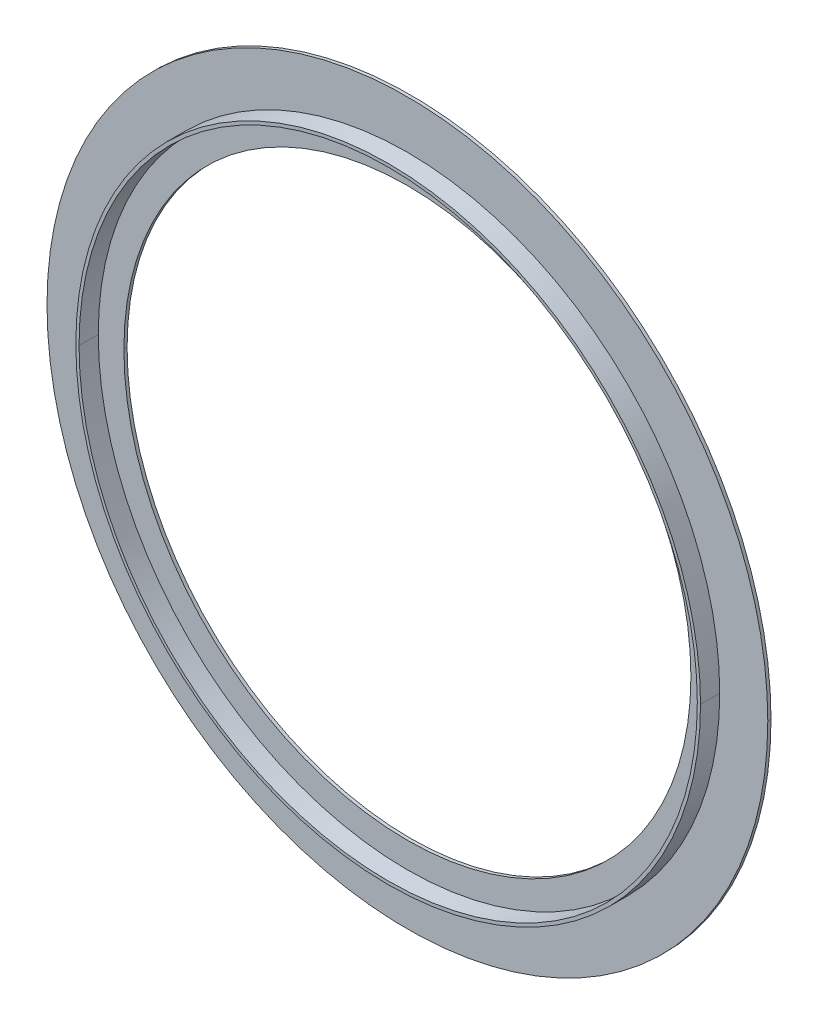
ISO-10303-21;
HEADER;
FILE_DESCRIPTION(('STEP AP214'),'2;1');
FILE_NAME('part.step','',(''),(''),'','','');
FILE_SCHEMA(('AUTOMOTIVE_DESIGN { 1 0 10303 214 1 1 1 1 }'));
ENDSEC;
DATA;
#1=APPLICATION_CONTEXT('core data for automotive mechanical design processes');
#2=APPLICATION_PROTOCOL_DEFINITION('international standard','automotive_design',2000,#1);
#3=PRODUCT_CONTEXT('',#1,'mechanical');
#4=PRODUCT('Part','Part','',(#3));
#5=PRODUCT_RELATED_PRODUCT_CATEGORY('part','',(#4));
#6=PRODUCT_DEFINITION_FORMATION('','',#4);
#7=PRODUCT_DEFINITION_CONTEXT('part definition',#1,'design');
#8=PRODUCT_DEFINITION('design','',#6,#7);
#9=PRODUCT_DEFINITION_SHAPE('','',#8);
#10=(LENGTH_UNIT() NAMED_UNIT(*) SI_UNIT(.MILLI.,.METRE.));
#11=(NAMED_UNIT(*) PLANE_ANGLE_UNIT() SI_UNIT($,.RADIAN.));
#12=(NAMED_UNIT(*) SI_UNIT($,.STERADIAN.) SOLID_ANGLE_UNIT());
#13=UNCERTAINTY_MEASURE_WITH_UNIT(LENGTH_MEASURE(1.E-05),#10,'distance_accuracy_value','');
#14=(GEOMETRIC_REPRESENTATION_CONTEXT(3) GLOBAL_UNCERTAINTY_ASSIGNED_CONTEXT((#13)) GLOBAL_UNIT_ASSIGNED_CONTEXT((#10,
#11,#12)) REPRESENTATION_CONTEXT('',''));
#15=CARTESIAN_POINT('',(0.,0.,0.));
#16=DIRECTION('',(0.,0.,1.));
#17=DIRECTION('',(1.,0.,0.));
#18=AXIS2_PLACEMENT_3D('',#15,#16,#17);
#19=CARTESIAN_POINT('',(0.,0.,7.));
#20=DIRECTION('',(0.,0.,-1.));
#21=DIRECTION('',(-1.,0.,0.));
#22=AXIS2_PLACEMENT_3D('',#19,#20,#21);
#23=CYLINDRICAL_SURFACE('',#22,96.5);
#24=CARTESIAN_POINT('',(0.,0.,7.));
#25=DIRECTION('',(0.,0.,1.));
#26=DIRECTION('',(1.,0.,0.));
#27=AXIS2_PLACEMENT_3D('',#24,#25,#26);
#28=CIRCLE('',#27,96.5);
#29=CARTESIAN_POINT('',(-96.5,0.,7.));
#30=VERTEX_POINT('',#29);
#31=CARTESIAN_POINT('',(96.5,0.,7.));
#32=VERTEX_POINT('',#31);
#33=EDGE_CURVE('E11',#30,#32,#28,.T.);
#34=ORIENTED_EDGE('',*,*,#33,.T.);
#35=DIRECTION('',(0.,0.,-1.));
#36=VECTOR('',#35,1.);
#37=CARTESIAN_POINT('',(96.5,0.,7.));
#38=LINE('',#37,#36);
#39=CARTESIAN_POINT('',(96.5,0.,1.));
#40=VERTEX_POINT('',#39);
#41=EDGE_CURVE('E26',#32,#40,#38,.T.);
#42=ORIENTED_EDGE('',*,*,#41,.T.);
#43=CARTESIAN_POINT('',(0.,0.,1.));
#44=DIRECTION('',(0.,0.,-1.));
#45=DIRECTION('',(1.,0.,0.));
#46=AXIS2_PLACEMENT_3D('',#43,#44,#45);
#47=CIRCLE('',#46,96.5);
#48=CARTESIAN_POINT('',(-96.5,0.,1.));
#49=VERTEX_POINT('',#48);
#50=EDGE_CURVE('E120',#40,#49,#47,.T.);
#51=ORIENTED_EDGE('',*,*,#50,.T.);
#52=DIRECTION('',(0.,0.,-1.));
#53=VECTOR('',#52,1.);
#54=CARTESIAN_POINT('',(-96.5,0.,7.));
#55=LINE('',#54,#53);
#56=EDGE_CURVE('E146',#30,#49,#55,.T.);
#57=ORIENTED_EDGE('',*,*,#56,.F.);
#58=EDGE_LOOP('',(#34,#42,#51,#57));
#59=FACE_BOUND('',#58,.T.);
#60=ADVANCED_FACE('F16',(#59),#23,.F.);
#61=CARTESIAN_POINT('',(0.,0.,7.));
#62=DIRECTION('',(0.,0.,-1.));
#63=DIRECTION('',(-1.,0.,0.));
#64=AXIS2_PLACEMENT_3D('',#61,#62,#63);
#65=CYLINDRICAL_SURFACE('',#64,97.5);
#66=CARTESIAN_POINT('',(0.,0.,7.));
#67=DIRECTION('',(0.,0.,1.));
#68=DIRECTION('',(1.,0.,0.));
#69=AXIS2_PLACEMENT_3D('',#66,#67,#68);
#70=CIRCLE('',#69,97.5);
#71=CARTESIAN_POINT('',(97.5,0.,7.));
#72=VERTEX_POINT('',#71);
#73=CARTESIAN_POINT('',(-97.5,0.,7.));
#74=VERTEX_POINT('',#73);
#75=EDGE_CURVE('E105',#72,#74,#70,.T.);
#76=ORIENTED_EDGE('',*,*,#75,.F.);
#77=DIRECTION('',(0.,0.,-1.));
#78=VECTOR('',#77,1.);
#79=CARTESIAN_POINT('',(97.5,0.,7.));
#80=LINE('',#79,#78);
#81=CARTESIAN_POINT('',(97.5,0.,1.));
#82=VERTEX_POINT('',#81);
#83=EDGE_CURVE('E108',#72,#82,#80,.T.);
#84=ORIENTED_EDGE('',*,*,#83,.T.);
#85=CARTESIAN_POINT('',(0.,0.,1.));
#86=DIRECTION('',(0.,0.,1.));
#87=DIRECTION('',(1.,0.,0.));
#88=AXIS2_PLACEMENT_3D('',#85,#86,#87);
#89=CIRCLE('',#88,97.5);
#90=CARTESIAN_POINT('',(-97.5,0.,1.));
#91=VERTEX_POINT('',#90);
#92=EDGE_CURVE('E96',#82,#91,#89,.T.);
#93=ORIENTED_EDGE('',*,*,#92,.T.);
#94=DIRECTION('',(0.,0.,-1.));
#95=VECTOR('',#94,1.);
#96=CARTESIAN_POINT('',(-97.5,0.,7.));
#97=LINE('',#96,#95);
#98=EDGE_CURVE('E110',#74,#91,#97,.T.);
#99=ORIENTED_EDGE('',*,*,#98,.F.);
#100=EDGE_LOOP('',(#76,#84,#93,#99));
#101=FACE_BOUND('',#100,.T.);
#102=ADVANCED_FACE('F107',(#101),#65,.T.);
#103=CARTESIAN_POINT('',(0.,0.,0.));
#104=DIRECTION('',(0.,0.,1.));
#105=DIRECTION('',(1.,0.,0.));
#106=AXIS2_PLACEMENT_3D('',#103,#104,#105);
#107=CYLINDRICAL_SURFACE('',#106,88.5);
#108=CARTESIAN_POINT('',(0.,0.,0.));
#109=DIRECTION('',(0.,0.,1.));
#110=DIRECTION('',(1.,0.,0.));
#111=AXIS2_PLACEMENT_3D('',#108,#109,#110);
#112=CIRCLE('',#111,88.5);
#113=CARTESIAN_POINT('',(-88.5,0.,0.));
#114=VERTEX_POINT('',#113);
#115=CARTESIAN_POINT('',(88.5,0.,0.));
#116=VERTEX_POINT('',#115);
#117=EDGE_CURVE('E141',#114,#116,#112,.T.);
#118=ORIENTED_EDGE('',*,*,#117,.F.);
#119=DIRECTION('',(0.,0.,1.));
#120=VECTOR('',#119,1.);
#121=CARTESIAN_POINT('',(-88.5,0.,0.));
#122=LINE('',#121,#120);
#123=CARTESIAN_POINT('',(-88.5,0.,1.));
#124=VERTEX_POINT('',#123);
#125=EDGE_CURVE('E162',#114,#124,#122,.T.);
#126=ORIENTED_EDGE('',*,*,#125,.T.);
#127=CARTESIAN_POINT('',(0.,0.,1.));
#128=DIRECTION('',(0.,0.,1.));
#129=DIRECTION('',(1.,0.,0.));
#130=AXIS2_PLACEMENT_3D('',#127,#128,#129);
#131=CIRCLE('',#130,88.5);
#132=CARTESIAN_POINT('',(88.5,0.,1.));
#133=VERTEX_POINT('',#132);
#134=EDGE_CURVE('E158',#124,#133,#131,.T.);
#135=ORIENTED_EDGE('',*,*,#134,.T.);
#136=DIRECTION('',(0.,0.,1.));
#137=VECTOR('',#136,1.);
#138=CARTESIAN_POINT('',(88.5,0.,0.));
#139=LINE('',#138,#137);
#140=EDGE_CURVE('E132',#116,#133,#139,.T.);
#141=ORIENTED_EDGE('',*,*,#140,.F.);
#142=EDGE_LOOP('',(#118,#126,#135,#141));
#143=FACE_BOUND('',#142,.T.);
#144=ADVANCED_FACE('F324',(#143),#107,.F.);
#145=CARTESIAN_POINT('',(0.,0.,1.));
#146=DIRECTION('',(0.,0.,-1.));
#147=DIRECTION('',(-1.,0.,0.));
#148=AXIS2_PLACEMENT_3D('',#145,#146,#147);
#149=CYLINDRICAL_SURFACE('',#148,112.5);
#150=CARTESIAN_POINT('',(0.,0.,1.));
#151=DIRECTION('',(0.,0.,1.));
#152=DIRECTION('',(1.,0.,0.));
#153=AXIS2_PLACEMENT_3D('',#150,#151,#152);
#154=CIRCLE('',#153,112.5);
#155=CARTESIAN_POINT('',(112.5,0.,1.));
#156=VERTEX_POINT('',#155);
#157=CARTESIAN_POINT('',(-112.5,0.,1.));
#158=VERTEX_POINT('',#157);
#159=EDGE_CURVE('E156',#156,#158,#154,.T.);
#160=ORIENTED_EDGE('',*,*,#159,.F.);
#161=DIRECTION('',(0.,0.,-1.));
#162=VECTOR('',#161,1.);
#163=CARTESIAN_POINT('',(112.5,0.,1.));
#164=LINE('',#163,#162);
#165=CARTESIAN_POINT('',(112.5,0.,0.));
#166=VERTEX_POINT('',#165);
#167=EDGE_CURVE('E163',#156,#166,#164,.T.);
#168=ORIENTED_EDGE('',*,*,#167,.T.);
#169=CARTESIAN_POINT('',(0.,0.,0.));
#170=DIRECTION('',(0.,0.,1.));
#171=DIRECTION('',(1.,0.,0.));
#172=AXIS2_PLACEMENT_3D('',#169,#170,#171);
#173=CIRCLE('',#172,112.5);
#174=CARTESIAN_POINT('',(-112.5,0.,0.));
#175=VERTEX_POINT('',#174);
#176=EDGE_CURVE('E168',#166,#175,#173,.T.);
#177=ORIENTED_EDGE('',*,*,#176,.T.);
#178=DIRECTION('',(0.,0.,-1.));
#179=VECTOR('',#178,1.);
#180=CARTESIAN_POINT('',(-112.5,0.,1.));
#181=LINE('',#180,#179);
#182=EDGE_CURVE('E153',#158,#175,#181,.T.);
#183=ORIENTED_EDGE('',*,*,#182,.F.);
#184=EDGE_LOOP('',(#160,#168,#177,#183));
#185=FACE_BOUND('',#184,.T.);
#186=ADVANCED_FACE('F216',(#185),#149,.T.);
#187=CARTESIAN_POINT('',(0.,0.,1.));
#188=DIRECTION('',(0.,0.,1.));
#189=DIRECTION('',(1.,0.,0.));
#190=AXIS2_PLACEMENT_3D('',#187,#188,#189);
#191=PLANE('',#190);
#192=CARTESIAN_POINT('',(0.,0.,1.));
#193=DIRECTION('',(0.,0.,1.));
#194=DIRECTION('',(1.,0.,0.));
#195=AXIS2_PLACEMENT_3D('',#192,#193,#194);
#196=CIRCLE('',#195,112.5);
#197=EDGE_CURVE('E164',#158,#156,#196,.T.);
#198=ORIENTED_EDGE('',*,*,#197,.T.);
#199=ORIENTED_EDGE('',*,*,#159,.T.);
#200=EDGE_LOOP('',(#198,#199));
#201=FACE_BOUND('',#200,.T.);
#202=CARTESIAN_POINT('',(0.,0.,1.));
#203=DIRECTION('',(0.,0.,1.));
#204=DIRECTION('',(1.,0.,0.));
#205=AXIS2_PLACEMENT_3D('',#202,#203,#204);
#206=CIRCLE('',#205,97.5);
#207=EDGE_CURVE('E118',#91,#82,#206,.T.);
#208=ORIENTED_EDGE('',*,*,#207,.F.);
#209=ORIENTED_EDGE('',*,*,#92,.F.);
#210=EDGE_LOOP('',(#208,#209));
#211=FACE_BOUND('',#210,.T.);
#212=ADVANCED_FACE('F221',(#201,#211),#191,.T.);
#213=CARTESIAN_POINT('',(0.,0.,1.));
#214=DIRECTION('',(0.,0.,-1.));
#215=DIRECTION('',(-1.,0.,0.));
#216=AXIS2_PLACEMENT_3D('',#213,#214,#215);
#217=CYLINDRICAL_SURFACE('',#216,112.5);
#218=ORIENTED_EDGE('',*,*,#167,.F.);
#219=ORIENTED_EDGE('',*,*,#197,.F.);
#220=ORIENTED_EDGE('',*,*,#182,.T.);
#221=CARTESIAN_POINT('',(0.,0.,0.));
#222=DIRECTION('',(0.,0.,1.));
#223=DIRECTION('',(1.,0.,0.));
#224=AXIS2_PLACEMENT_3D('',#221,#222,#223);
#225=CIRCLE('',#224,112.5);
#226=EDGE_CURVE('E157',#175,#166,#225,.T.);
#227=ORIENTED_EDGE('',*,*,#226,.T.);
#228=EDGE_LOOP('',(#218,#219,#220,#227));
#229=FACE_BOUND('',#228,.T.);
#230=ADVANCED_FACE('F219',(#229),#217,.T.);
#231=CARTESIAN_POINT('',(0.,0.,1.));
#232=DIRECTION('',(0.,0.,1.));
#233=DIRECTION('',(1.,0.,0.));
#234=AXIS2_PLACEMENT_3D('',#231,#232,#233);
#235=PLANE('',#234);
#236=CARTESIAN_POINT('',(0.,0.,1.));
#237=DIRECTION('',(0.,0.,-1.));
#238=DIRECTION('',(1.,0.,0.));
#239=AXIS2_PLACEMENT_3D('',#236,#237,#238);
#240=CIRCLE('',#239,96.5);
#241=EDGE_CURVE('E144',#49,#40,#240,.T.);
#242=ORIENTED_EDGE('',*,*,#241,.F.);
#243=ORIENTED_EDGE('',*,*,#50,.F.);
#244=EDGE_LOOP('',(#242,#243));
#245=FACE_BOUND('',#244,.T.);
#246=CARTESIAN_POINT('',(0.,0.,1.));
#247=DIRECTION('',(0.,0.,1.));
#248=DIRECTION('',(1.,0.,0.));
#249=AXIS2_PLACEMENT_3D('',#246,#247,#248);
#250=CIRCLE('',#249,88.5);
#251=EDGE_CURVE('E125',#133,#124,#250,.T.);
#252=ORIENTED_EDGE('',*,*,#251,.F.);
#253=ORIENTED_EDGE('',*,*,#134,.F.);
#254=EDGE_LOOP('',(#252,#253));
#255=FACE_BOUND('',#254,.T.);
#256=ADVANCED_FACE('F309',(#245,#255),#235,.T.);
#257=CARTESIAN_POINT('',(0.,0.,0.));
#258=DIRECTION('',(0.,0.,1.));
#259=DIRECTION('',(1.,0.,0.));
#260=AXIS2_PLACEMENT_3D('',#257,#258,#259);
#261=PLANE('',#260);
#262=ORIENTED_EDGE('',*,*,#226,.F.);
#263=ORIENTED_EDGE('',*,*,#176,.F.);
#264=EDGE_LOOP('',(#262,#263));
#265=FACE_BOUND('',#264,.T.);
#266=CARTESIAN_POINT('',(0.,0.,0.));
#267=DIRECTION('',(0.,0.,1.));
#268=DIRECTION('',(1.,0.,0.));
#269=AXIS2_PLACEMENT_3D('',#266,#267,#268);
#270=CIRCLE('',#269,88.5);
#271=EDGE_CURVE('E152',#116,#114,#270,.T.);
#272=ORIENTED_EDGE('',*,*,#271,.T.);
#273=ORIENTED_EDGE('',*,*,#117,.T.);
#274=EDGE_LOOP('',(#272,#273));
#275=FACE_BOUND('',#274,.T.);
#276=ADVANCED_FACE('F304',(#265,#275),#261,.F.);
#277=CARTESIAN_POINT('',(0.,0.,0.));
#278=DIRECTION('',(0.,0.,1.));
#279=DIRECTION('',(1.,0.,0.));
#280=AXIS2_PLACEMENT_3D('',#277,#278,#279);
#281=CYLINDRICAL_SURFACE('',#280,88.5);
#282=ORIENTED_EDGE('',*,*,#125,.F.);
#283=ORIENTED_EDGE('',*,*,#271,.F.);
#284=ORIENTED_EDGE('',*,*,#140,.T.);
#285=ORIENTED_EDGE('',*,*,#251,.T.);
#286=EDGE_LOOP('',(#282,#283,#284,#285));
#287=FACE_BOUND('',#286,.T.);
#288=ADVANCED_FACE('F308',(#287),#281,.F.);
#289=CARTESIAN_POINT('',(0.,0.,7.));
#290=DIRECTION('',(0.,0.,1.));
#291=DIRECTION('',(1.,0.,0.));
#292=AXIS2_PLACEMENT_3D('',#289,#290,#291);
#293=PLANE('',#292);
#294=CARTESIAN_POINT('',(0.,0.,7.));
#295=DIRECTION('',(0.,0.,1.));
#296=DIRECTION('',(1.,0.,0.));
#297=AXIS2_PLACEMENT_3D('',#294,#295,#296);
#298=CIRCLE('',#297,97.5);
#299=EDGE_CURVE('E19',#74,#72,#298,.T.);
#300=ORIENTED_EDGE('',*,*,#299,.T.);
#301=ORIENTED_EDGE('',*,*,#75,.T.);
#302=EDGE_LOOP('',(#300,#301));
#303=FACE_BOUND('',#302,.T.);
#304=ORIENTED_EDGE('',*,*,#33,.F.);
#305=CARTESIAN_POINT('',(0.,0.,7.));
#306=DIRECTION('',(0.,0.,1.));
#307=DIRECTION('',(1.,0.,0.));
#308=AXIS2_PLACEMENT_3D('',#305,#306,#307);
#309=CIRCLE('',#308,96.5);
#310=EDGE_CURVE('E170',#32,#30,#309,.T.);
#311=ORIENTED_EDGE('',*,*,#310,.F.);
#312=EDGE_LOOP('',(#304,#311));
#313=FACE_BOUND('',#312,.T.);
#314=ADVANCED_FACE('F122',(#303,#313),#293,.T.);
#315=CARTESIAN_POINT('',(0.,0.,7.));
#316=DIRECTION('',(0.,0.,-1.));
#317=DIRECTION('',(-1.,0.,0.));
#318=AXIS2_PLACEMENT_3D('',#315,#316,#317);
#319=CYLINDRICAL_SURFACE('',#318,97.5);
#320=ORIENTED_EDGE('',*,*,#83,.F.);
#321=ORIENTED_EDGE('',*,*,#299,.F.);
#322=ORIENTED_EDGE('',*,*,#98,.T.);
#323=ORIENTED_EDGE('',*,*,#207,.T.);
#324=EDGE_LOOP('',(#320,#321,#322,#323));
#325=FACE_BOUND('',#324,.T.);
#326=ADVANCED_FACE('F117',(#325),#319,.T.);
#327=CARTESIAN_POINT('',(0.,0.,7.));
#328=DIRECTION('',(0.,0.,-1.));
#329=DIRECTION('',(-1.,0.,0.));
#330=AXIS2_PLACEMENT_3D('',#327,#328,#329);
#331=CYLINDRICAL_SURFACE('',#330,96.5);
#332=ORIENTED_EDGE('',*,*,#41,.F.);
#333=ORIENTED_EDGE('',*,*,#310,.T.);
#334=ORIENTED_EDGE('',*,*,#56,.T.);
#335=ORIENTED_EDGE('',*,*,#241,.T.);
#336=EDGE_LOOP('',(#332,#333,#334,#335));
#337=FACE_BOUND('',#336,.T.);
#338=ADVANCED_FACE('F354',(#337),#331,.F.);
#339=CLOSED_SHELL('',(#60,#102,#144,#186,#212,#230,#256,#276,#288,#314,#326,#338));
#340=MANIFOLD_SOLID_BREP('B1',#339);
#341=ADVANCED_BREP_SHAPE_REPRESENTATION('',(#18,#340),#14);
#342=SHAPE_DEFINITION_REPRESENTATION(#9,#341);
ENDSEC;
END-ISO-10303-21;
